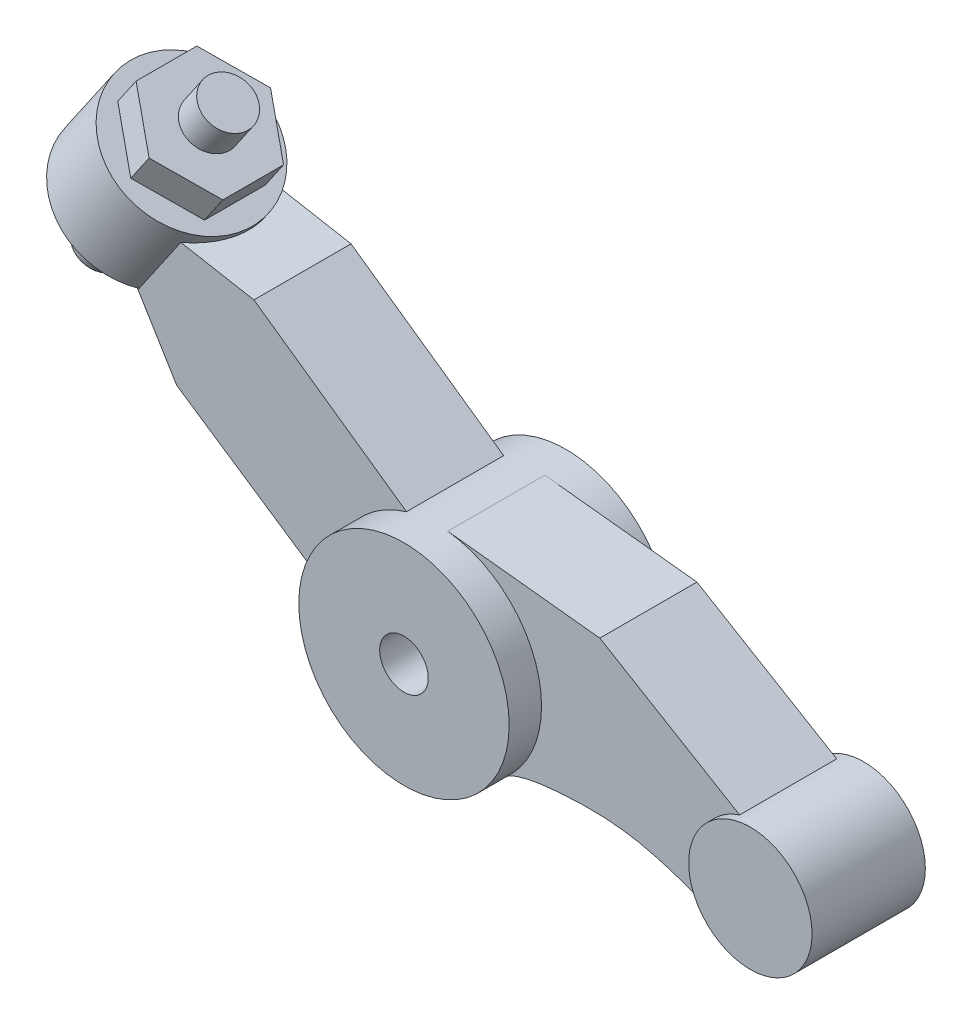
ISO-10303-21;
HEADER;
FILE_DESCRIPTION(('STEP AP214'),'2;1');
FILE_NAME('part.step','',(''),(''),'','','');
FILE_SCHEMA(('AUTOMOTIVE_DESIGN { 1 0 10303 214 1 1 1 1 }'));
ENDSEC;
DATA;
#1=APPLICATION_CONTEXT('core data for automotive mechanical design processes');
#2=APPLICATION_PROTOCOL_DEFINITION('international standard','automotive_design',2000,#1);
#3=PRODUCT_CONTEXT('',#1,'mechanical');
#4=PRODUCT('Part','Part','',(#3));
#5=PRODUCT_RELATED_PRODUCT_CATEGORY('part','',(#4));
#6=PRODUCT_DEFINITION_FORMATION('','',#4);
#7=PRODUCT_DEFINITION_CONTEXT('part definition',#1,'design');
#8=PRODUCT_DEFINITION('design','',#6,#7);
#9=PRODUCT_DEFINITION_SHAPE('','',#8);
#10=(LENGTH_UNIT() NAMED_UNIT(*) SI_UNIT(.MILLI.,.METRE.));
#11=(NAMED_UNIT(*) PLANE_ANGLE_UNIT() SI_UNIT($,.RADIAN.));
#12=(NAMED_UNIT(*) SI_UNIT($,.STERADIAN.) SOLID_ANGLE_UNIT());
#13=UNCERTAINTY_MEASURE_WITH_UNIT(LENGTH_MEASURE(1.E-05),#10,'distance_accuracy_value','');
#14=(GEOMETRIC_REPRESENTATION_CONTEXT(3) GLOBAL_UNCERTAINTY_ASSIGNED_CONTEXT((#13)) GLOBAL_UNIT_ASSIGNED_CONTEXT((#10,
#11,#12)) REPRESENTATION_CONTEXT('',''));
#15=CARTESIAN_POINT('',(0.,0.,0.));
#16=DIRECTION('',(0.,0.,1.));
#17=DIRECTION('',(1.,0.,0.));
#18=AXIS2_PLACEMENT_3D('',#15,#16,#17);
#19=CARTESIAN_POINT('',(0.,0.,1.));
#20=DIRECTION('',(0.,0.,-1.));
#21=DIRECTION('',(-1.,0.,0.));
#22=AXIS2_PLACEMENT_3D('',#19,#20,#21);
#23=CYLINDRICAL_SURFACE('',#22,0.3);
#24=CARTESIAN_POINT('',(0.,0.,1.));
#25=DIRECTION('',(0.,0.,1.));
#26=DIRECTION('',(1.,0.,0.));
#27=AXIS2_PLACEMENT_3D('',#24,#25,#26);
#28=CIRCLE('',#27,0.3);
#29=CARTESIAN_POINT('',(0.3,0.,1.));
#30=VERTEX_POINT('',#29);
#31=EDGE_CURVE('E330',#30,#30,#28,.T.);
#32=ORIENTED_EDGE('',*,*,#31,.T.);
#33=EDGE_LOOP('',(#32));
#34=FACE_BOUND('',#33,.T.);
#35=CARTESIAN_POINT('',(0.,0.,-1.));
#36=DIRECTION('',(0.,0.,1.));
#37=DIRECTION('',(1.,0.,0.));
#38=AXIS2_PLACEMENT_3D('',#35,#36,#37);
#39=CIRCLE('',#38,0.3);
#40=CARTESIAN_POINT('',(0.3,0.,-1.));
#41=VERTEX_POINT('',#40);
#42=EDGE_CURVE('E331',#41,#41,#39,.T.);
#43=ORIENTED_EDGE('',*,*,#42,.F.);
#44=EDGE_LOOP('',(#43));
#45=FACE_BOUND('',#44,.T.);
#46=ADVANCED_FACE('F41',(#34,#45),#23,.F.);
#47=CARTESIAN_POINT('',(0.,0.,1.));
#48=DIRECTION('',(0.,0.,-1.));
#49=DIRECTION('',(-1.,0.,0.));
#50=AXIS2_PLACEMENT_3D('',#47,#48,#49);
#51=CYLINDRICAL_SURFACE('',#50,1.3);
#52=DIRECTION('',(0.,0.,-1.));
#53=VECTOR('',#52,1.);
#54=CARTESIAN_POINT('',(-0.368782160994087,1.24659525016444,0.6));
#55=LINE('',#54,#53);
#56=CARTESIAN_POINT('',(-0.368782160994086,1.24659525016444,0.6));
#57=VERTEX_POINT('',#56);
#58=CARTESIAN_POINT('',(-0.368782160994086,1.24659525016444,-0.6));
#59=VERTEX_POINT('',#58);
#60=EDGE_CURVE('E268',#57,#59,#55,.T.);
#61=ORIENTED_EDGE('',*,*,#60,.F.);
#62=CARTESIAN_POINT('',(0.,0.,0.6));
#63=DIRECTION('',(0.,0.,1.));
#64=DIRECTION('',(1.,0.,0.));
#65=AXIS2_PLACEMENT_3D('',#62,#63,#64);
#66=CIRCLE('',#65,1.3);
#67=CARTESIAN_POINT('',(-1.29584863415519,-0.103809042756995,0.6));
#68=VERTEX_POINT('',#67);
#69=EDGE_CURVE('E223',#57,#68,#66,.T.);
#70=ORIENTED_EDGE('',*,*,#69,.T.);
#71=DIRECTION('',(0.,0.,-1.));
#72=VECTOR('',#71,1.);
#73=CARTESIAN_POINT('',(-1.29584863415519,-0.103809042756995,0.6));
#74=LINE('',#73,#72);
#75=CARTESIAN_POINT('',(-1.29584863415519,-0.103809042756995,-0.6));
#76=VERTEX_POINT('',#75);
#77=EDGE_CURVE('E241',#68,#76,#74,.T.);
#78=ORIENTED_EDGE('',*,*,#77,.T.);
#79=CARTESIAN_POINT('',(0.,0.,-0.6));
#80=DIRECTION('',(0.,0.,1.));
#81=DIRECTION('',(1.,0.,0.));
#82=AXIS2_PLACEMENT_3D('',#79,#80,#81);
#83=CIRCLE('',#82,1.3);
#84=EDGE_CURVE('E222',#59,#76,#83,.T.);
#85=ORIENTED_EDGE('',*,*,#84,.F.);
#86=EDGE_LOOP('',(#61,#70,#78,#85));
#87=FACE_BOUND('',#86,.T.);
#88=DIRECTION('',(0.,0.,-1.));
#89=VECTOR('',#88,1.);
#90=CARTESIAN_POINT('',(0.856533864157858,-0.977931357279645,0.6));
#91=LINE('',#90,#89);
#92=CARTESIAN_POINT('',(0.856533864157858,-0.977931357279645,0.6));
#93=VERTEX_POINT('',#92);
#94=CARTESIAN_POINT('',(0.856533864157858,-0.977931357279645,-0.6));
#95=VERTEX_POINT('',#94);
#96=EDGE_CURVE('E320',#93,#95,#91,.T.);
#97=ORIENTED_EDGE('',*,*,#96,.F.);
#98=CARTESIAN_POINT('',(0.,0.,0.6));
#99=DIRECTION('',(0.,0.,1.));
#100=DIRECTION('',(1.,0.,0.));
#101=AXIS2_PLACEMENT_3D('',#98,#99,#100);
#102=CIRCLE('',#101,1.3);
#103=CARTESIAN_POINT('',(0.140477620780461,1.29238772744864,0.6));
#104=VERTEX_POINT('',#103);
#105=EDGE_CURVE('E442',#93,#104,#102,.T.);
#106=ORIENTED_EDGE('',*,*,#105,.T.);
#107=DIRECTION('',(0.,0.,-1.));
#108=VECTOR('',#107,1.);
#109=CARTESIAN_POINT('',(0.140477620780461,1.29238772744864,0.6));
#110=LINE('',#109,#108);
#111=CARTESIAN_POINT('',(0.140477620780461,1.29238772744864,-0.6));
#112=VERTEX_POINT('',#111);
#113=EDGE_CURVE('E426',#104,#112,#110,.T.);
#114=ORIENTED_EDGE('',*,*,#113,.T.);
#115=CARTESIAN_POINT('',(0.,0.,-0.6));
#116=DIRECTION('',(0.,0.,1.));
#117=DIRECTION('',(1.,0.,0.));
#118=AXIS2_PLACEMENT_3D('',#115,#116,#117);
#119=CIRCLE('',#118,1.3);
#120=EDGE_CURVE('E289',#95,#112,#119,.T.);
#121=ORIENTED_EDGE('',*,*,#120,.F.);
#122=EDGE_LOOP('',(#97,#106,#114,#121));
#123=FACE_BOUND('',#122,.T.);
#124=CARTESIAN_POINT('',(0.,0.,1.));
#125=DIRECTION('',(0.,0.,1.));
#126=DIRECTION('',(1.,0.,0.));
#127=AXIS2_PLACEMENT_3D('',#124,#125,#126);
#128=CIRCLE('',#127,1.3);
#129=CARTESIAN_POINT('',(1.3,0.,1.));
#130=VERTEX_POINT('',#129);
#131=EDGE_CURVE('E324',#130,#130,#128,.T.);
#132=ORIENTED_EDGE('',*,*,#131,.F.);
#133=EDGE_LOOP('',(#132));
#134=FACE_BOUND('',#133,.T.);
#135=CARTESIAN_POINT('',(0.,0.,-1.));
#136=DIRECTION('',(0.,0.,1.));
#137=DIRECTION('',(1.,0.,0.));
#138=AXIS2_PLACEMENT_3D('',#135,#136,#137);
#139=CIRCLE('',#138,1.3);
#140=CARTESIAN_POINT('',(1.3,0.,-1.));
#141=VERTEX_POINT('',#140);
#142=EDGE_CURVE('E327',#141,#141,#139,.T.);
#143=ORIENTED_EDGE('',*,*,#142,.T.);
#144=EDGE_LOOP('',(#143));
#145=FACE_BOUND('',#144,.T.);
#146=ADVANCED_FACE('F306',(#87,#123,#134,#145),#51,.T.);
#147=CARTESIAN_POINT('',(0.,0.,1.));
#148=DIRECTION('',(0.,0.,1.));
#149=DIRECTION('',(1.,0.,0.));
#150=AXIS2_PLACEMENT_3D('',#147,#148,#149);
#151=PLANE('',#150);
#152=ORIENTED_EDGE('',*,*,#31,.F.);
#153=EDGE_LOOP('',(#152));
#154=FACE_BOUND('',#153,.T.);
#155=ORIENTED_EDGE('',*,*,#131,.T.);
#156=EDGE_LOOP('',(#155));
#157=FACE_BOUND('',#156,.T.);
#158=ADVANCED_FACE('F303',(#154,#157),#151,.T.);
#159=CARTESIAN_POINT('',(0.,0.,-1.));
#160=DIRECTION('',(0.,0.,1.));
#161=DIRECTION('',(1.,0.,0.));
#162=AXIS2_PLACEMENT_3D('',#159,#160,#161);
#163=PLANE('',#162);
#164=ORIENTED_EDGE('',*,*,#42,.T.);
#165=EDGE_LOOP('',(#164));
#166=FACE_BOUND('',#165,.T.);
#167=ORIENTED_EDGE('',*,*,#142,.F.);
#168=EDGE_LOOP('',(#167));
#169=FACE_BOUND('',#168,.T.);
#170=ADVANCED_FACE('F300',(#166,#169),#163,.F.);
#171=CARTESIAN_POINT('',(3.37435099411818,-1.12949006021291,0.6));
#172=CARTESIAN_POINT('',(2.7784763450981,-0.906598449555671,0.6));
#173=CARTESIAN_POINT('',(2.40696699317631,-0.786012748574951,0.6));
#174=CARTESIAN_POINT('',(1.50197991959616,-0.807474496325773,0.6));
#175=CARTESIAN_POINT('',(0.99648315509414,-0.855354955511263,0.6));
#176=CARTESIAN_POINT('',(0.856533864157858,-0.977931357279645,0.6));
#177=B_SPLINE_CURVE_WITH_KNOTS('',3,(#171,#172,#173,#174,#175,#176),.UNSPECIFIED.,.F.,.F.,(4,1,
1,4),(0.,0.647248285514099,0.718239716660931,1.),.UNSPECIFIED.);
#178=DIRECTION('',(0.,0.,-1.));
#179=VECTOR('',#178,1.);
#180=SURFACE_OF_LINEAR_EXTRUSION('',#177,#179);
#181=CARTESIAN_POINT('',(3.37435099411818,-1.12949006021291,-0.6));
#182=CARTESIAN_POINT('',(2.7784763450981,-0.906598449555671,-0.6));
#183=CARTESIAN_POINT('',(2.40696699317631,-0.786012748574951,-0.6));
#184=CARTESIAN_POINT('',(1.50197991959616,-0.807474496325773,-0.6));
#185=CARTESIAN_POINT('',(0.99648315509414,-0.855354955511263,-0.6));
#186=CARTESIAN_POINT('',(0.856533864157858,-0.977931357279645,-0.6));
#187=B_SPLINE_CURVE_WITH_KNOTS('',3,(#181,#182,#183,#184,#185,#186),.UNSPECIFIED.,.F.,.F.,(4,1,
1,4),(0.,0.647248285514099,0.718239716660931,1.),.UNSPECIFIED.);
#188=CARTESIAN_POINT('',(3.37435099411818,-1.12949006021291,-0.6));
#189=VERTEX_POINT('',#188);
#190=EDGE_CURVE('E277',#189,#95,#187,.T.);
#191=ORIENTED_EDGE('',*,*,#190,.F.);
#192=DIRECTION('',(0.,0.,-1.));
#193=VECTOR('',#192,1.);
#194=CARTESIAN_POINT('',(3.37435099411818,-1.12949006021291,0.6));
#195=LINE('',#194,#193);
#196=CARTESIAN_POINT('',(3.37435099411818,-1.12949006021291,0.6));
#197=VERTEX_POINT('',#196);
#198=EDGE_CURVE('E338',#197,#189,#195,.T.);
#199=ORIENTED_EDGE('',*,*,#198,.F.);
#200=EDGE_CURVE('E281',#197,#93,#177,.T.);
#201=ORIENTED_EDGE('',*,*,#200,.T.);
#202=ORIENTED_EDGE('',*,*,#96,.T.);
#203=EDGE_LOOP('',(#191,#199,#201,#202));
#204=FACE_BOUND('',#203,.T.);
#205=ADVANCED_FACE('F295',(#204),#180,.T.);
#206=CARTESIAN_POINT('',(1.00677750375807,1.69124025540544,0.6));
#207=DIRECTION('',(-0.51151645102772,-0.859273484013097,0.));
#208=DIRECTION('',(0.859273484013097,-0.51151645102772,0.));
#209=AXIS2_PLACEMENT_3D('',#206,#207,#208);
#210=PLANE('',#209);
#211=DIRECTION('',(-0.859273484013097,0.51151645102772,0.));
#212=VECTOR('',#211,1.);
#213=CARTESIAN_POINT('',(1.00677750375807,1.69124025540544,-0.6));
#214=LINE('',#213,#212);
#215=CARTESIAN_POINT('',(3.74725300527709,0.0598640652330697,-0.6));
#216=VERTEX_POINT('',#215);
#217=CARTESIAN_POINT('',(2.01997692525244,1.08809331568416,-0.6));
#218=VERTEX_POINT('',#217);
#219=EDGE_CURVE('E431',#216,#218,#214,.T.);
#220=ORIENTED_EDGE('',*,*,#219,.T.);
#221=DIRECTION('',(0.,0.,-1.));
#222=VECTOR('',#221,1.);
#223=CARTESIAN_POINT('',(2.01997692525244,1.08809331568416,0.6));
#224=LINE('',#223,#222);
#225=CARTESIAN_POINT('',(2.01997692525244,1.08809331568416,0.6));
#226=VERTEX_POINT('',#225);
#227=EDGE_CURVE('E428',#226,#218,#224,.T.);
#228=ORIENTED_EDGE('',*,*,#227,.F.);
#229=DIRECTION('',(-0.859273484013097,0.51151645102772,0.));
#230=VECTOR('',#229,1.);
#231=CARTESIAN_POINT('',(1.00677750375807,1.69124025540544,0.6));
#232=LINE('',#231,#230);
#233=CARTESIAN_POINT('',(3.74725300527709,0.0598640652330697,0.6));
#234=VERTEX_POINT('',#233);
#235=EDGE_CURVE('E475',#234,#226,#232,.T.);
#236=ORIENTED_EDGE('',*,*,#235,.F.);
#237=DIRECTION('',(0.,0.,-1.));
#238=VECTOR('',#237,1.);
#239=CARTESIAN_POINT('',(3.7472530052771,0.05986406523307,0.6));
#240=LINE('',#239,#238);
#241=EDGE_CURVE('E447',#234,#216,#240,.T.);
#242=ORIENTED_EDGE('',*,*,#241,.T.);
#243=EDGE_LOOP('',(#220,#228,#236,#242));
#244=FACE_BOUND('',#243,.T.);
#245=ADVANCED_FACE('F299',(#244),#210,.F.);
#246=CARTESIAN_POINT('',(0.140477620780461,1.29238772744864,0.6));
#247=DIRECTION('',(-0.108059708292662,-0.994144405729723,0.));
#248=DIRECTION('',(0.994144405729724,-0.108059708292662,0.));
#249=AXIS2_PLACEMENT_3D('',#246,#247,#248);
#250=PLANE('',#249);
#251=DIRECTION('',(-0.994144405729723,0.108059708292662,0.));
#252=VECTOR('',#251,1.);
#253=CARTESIAN_POINT('',(0.140477620780461,1.29238772744864,-0.6));
#254=LINE('',#253,#252);
#255=EDGE_CURVE('E423',#218,#112,#254,.T.);
#256=ORIENTED_EDGE('',*,*,#255,.T.);
#257=ORIENTED_EDGE('',*,*,#113,.F.);
#258=DIRECTION('',(-0.994144405729723,0.108059708292662,0.));
#259=VECTOR('',#258,1.);
#260=CARTESIAN_POINT('',(0.140477620780461,1.29238772744864,0.6));
#261=LINE('',#260,#259);
#262=EDGE_CURVE('E472',#226,#104,#261,.T.);
#263=ORIENTED_EDGE('',*,*,#262,.F.);
#264=ORIENTED_EDGE('',*,*,#227,.T.);
#265=EDGE_LOOP('',(#256,#257,#263,#264));
#266=FACE_BOUND('',#265,.T.);
#267=ADVANCED_FACE('F409',(#266),#250,.F.);
#268=CARTESIAN_POINT('',(0.,0.,0.6));
#269=DIRECTION('',(0.,0.,1.));
#270=DIRECTION('',(1.,0.,0.));
#271=AXIS2_PLACEMENT_3D('',#268,#269,#270);
#272=PLANE('',#271);
#273=ORIENTED_EDGE('',*,*,#200,.F.);
#274=CARTESIAN_POINT('',(3.98,-0.666245490169871,0.6));
#275=DIRECTION('',(0.,0.,1.));
#276=DIRECTION('',(1.,0.,0.));
#277=AXIS2_PLACEMENT_3D('',#274,#275,#276);
#278=CIRCLE('',#277,0.7625);
#279=EDGE_CURVE('E288',#234,#197,#278,.T.);
#280=ORIENTED_EDGE('',*,*,#279,.F.);
#281=ORIENTED_EDGE('',*,*,#235,.T.);
#282=ORIENTED_EDGE('',*,*,#262,.T.);
#283=ORIENTED_EDGE('',*,*,#105,.F.);
#284=EDGE_LOOP('',(#273,#280,#281,#282,#283));
#285=FACE_BOUND('',#284,.T.);
#286=ADVANCED_FACE('F406',(#285),#272,.T.);
#287=CARTESIAN_POINT('',(0.,0.,-0.6));
#288=DIRECTION('',(0.,0.,1.));
#289=DIRECTION('',(1.,0.,0.));
#290=AXIS2_PLACEMENT_3D('',#287,#288,#289);
#291=PLANE('',#290);
#292=ORIENTED_EDGE('',*,*,#190,.T.);
#293=ORIENTED_EDGE('',*,*,#120,.T.);
#294=ORIENTED_EDGE('',*,*,#255,.F.);
#295=ORIENTED_EDGE('',*,*,#219,.F.);
#296=CARTESIAN_POINT('',(3.98,-0.666245490169871,-0.6));
#297=DIRECTION('',(0.,0.,1.));
#298=DIRECTION('',(1.,0.,0.));
#299=AXIS2_PLACEMENT_3D('',#296,#297,#298);
#300=CIRCLE('',#299,0.7625);
#301=EDGE_CURVE('E456',#216,#189,#300,.T.);
#302=ORIENTED_EDGE('',*,*,#301,.T.);
#303=EDGE_LOOP('',(#292,#293,#294,#295,#302));
#304=FACE_BOUND('',#303,.T.);
#305=ADVANCED_FACE('F404',(#304),#291,.F.);
#306=CARTESIAN_POINT('',(3.98,-0.666245490169871,0.7));
#307=DIRECTION('',(0.,0.,-1.));
#308=DIRECTION('',(-1.,0.,0.));
#309=AXIS2_PLACEMENT_3D('',#306,#307,#308);
#310=CYLINDRICAL_SURFACE('',#309,0.7625);
#311=ORIENTED_EDGE('',*,*,#279,.T.);
#312=ORIENTED_EDGE('',*,*,#198,.T.);
#313=ORIENTED_EDGE('',*,*,#301,.F.);
#314=ORIENTED_EDGE('',*,*,#241,.F.);
#315=EDGE_LOOP('',(#311,#312,#313,#314));
#316=FACE_BOUND('',#315,.T.);
#317=CARTESIAN_POINT('',(3.98,-0.666245490169871,0.7));
#318=DIRECTION('',(0.,0.,1.));
#319=DIRECTION('',(1.,0.,0.));
#320=AXIS2_PLACEMENT_3D('',#317,#318,#319);
#321=CIRCLE('',#320,0.7625);
#322=CARTESIAN_POINT('',(4.7425,-0.666245490169871,0.7));
#323=VERTEX_POINT('',#322);
#324=EDGE_CURVE('E273',#323,#323,#321,.T.);
#325=ORIENTED_EDGE('',*,*,#324,.F.);
#326=EDGE_LOOP('',(#325));
#327=FACE_BOUND('',#326,.T.);
#328=CARTESIAN_POINT('',(3.98,-0.666245490169871,-0.7));
#329=DIRECTION('',(0.,0.,1.));
#330=DIRECTION('',(1.,0.,0.));
#331=AXIS2_PLACEMENT_3D('',#328,#329,#330);
#332=CIRCLE('',#331,0.7625);
#333=CARTESIAN_POINT('',(4.7425,-0.666245490169871,-0.7));
#334=VERTEX_POINT('',#333);
#335=EDGE_CURVE('E272',#334,#334,#332,.T.);
#336=ORIENTED_EDGE('',*,*,#335,.T.);
#337=EDGE_LOOP('',(#336));
#338=FACE_BOUND('',#337,.T.);
#339=ADVANCED_FACE('F397',(#316,#327,#338),#310,.T.);
#340=CARTESIAN_POINT('',(0.,0.,0.7));
#341=DIRECTION('',(0.,0.,1.));
#342=DIRECTION('',(1.,0.,0.));
#343=AXIS2_PLACEMENT_3D('',#340,#341,#342);
#344=PLANE('',#343);
#345=ORIENTED_EDGE('',*,*,#324,.T.);
#346=EDGE_LOOP('',(#345));
#347=FACE_BOUND('',#346,.T.);
#348=ADVANCED_FACE('F394',(#347),#344,.T.);
#349=CARTESIAN_POINT('',(0.,0.,-0.7));
#350=DIRECTION('',(0.,0.,1.));
#351=DIRECTION('',(1.,0.,0.));
#352=AXIS2_PLACEMENT_3D('',#349,#350,#351);
#353=PLANE('',#352);
#354=ORIENTED_EDGE('',*,*,#335,.F.);
#355=EDGE_LOOP('',(#354));
#356=FACE_BOUND('',#355,.T.);
#357=ADVANCED_FACE('F393',(#356),#353,.F.);
#358=CARTESIAN_POINT('',(0.464485667568718,0.661494036164967,0.6));
#359=DIRECTION('',(0.574657276817286,0.818394167990548,0.));
#360=DIRECTION('',(-0.818394167990548,0.574657276817286,0.));
#361=AXIS2_PLACEMENT_3D('',#358,#359,#360);
#362=PLANE('',#361);
#363=DIRECTION('',(0.818394167990548,-0.574657276817286,0.));
#364=VECTOR('',#363,1.);
#365=CARTESIAN_POINT('',(0.464485667568718,0.661494036164967,-0.6));
#366=LINE('',#365,#364);
#367=CARTESIAN_POINT('',(-2.25421296575328,2.57050074004674,-0.6));
#368=VERTEX_POINT('',#367);
#369=EDGE_CURVE('E245',#368,#59,#366,.T.);
#370=ORIENTED_EDGE('',*,*,#369,.F.);
#371=DIRECTION('',(0.,0.,-1.));
#372=VECTOR('',#371,1.);
#373=CARTESIAN_POINT('',(-2.25421296575328,2.57050074004674,0.6));
#374=LINE('',#373,#372);
#375=CARTESIAN_POINT('',(-2.25421296575328,2.57050074004674,0.6));
#376=VERTEX_POINT('',#375);
#377=EDGE_CURVE('E264',#376,#368,#374,.T.);
#378=ORIENTED_EDGE('',*,*,#377,.F.);
#379=DIRECTION('',(0.818394167990548,-0.574657276817286,0.));
#380=VECTOR('',#379,1.);
#381=CARTESIAN_POINT('',(0.464485667568718,0.661494036164967,0.6));
#382=LINE('',#381,#380);
#383=EDGE_CURVE('E226',#376,#57,#382,.T.);
#384=ORIENTED_EDGE('',*,*,#383,.T.);
#385=ORIENTED_EDGE('',*,*,#60,.T.);
#386=EDGE_LOOP('',(#370,#378,#384,#385));
#387=FACE_BOUND('',#386,.T.);
#388=ADVANCED_FACE('F376',(#387),#362,.T.);
#389=CARTESIAN_POINT('',(0.37991682349805,2.09216938171615,0.6));
#390=DIRECTION('',(0.17866801025971,0.983909417634487,0.));
#391=DIRECTION('',(-0.983909417634487,0.17866801025971,0.));
#392=AXIS2_PLACEMENT_3D('',#389,#390,#391);
#393=PLANE('',#392);
#394=CARTESIAN_POINT('',(-3.89543486034177,2.86853005559673,0.));
#395=DIRECTION('',(0.17866801025971,0.983909417634487,0.));
#396=DIRECTION('',(0.983909417634487,-0.17866801025971,0.));
#397=AXIS2_PLACEMENT_3D('',#394,#395,#396);
#398=ELLIPSE('',#397,0.997502113347114,0.91);
#399=CARTESIAN_POINT('',(-3.15753594796304,2.73453506776088,0.6));
#400=VERTEX_POINT('',#399);
#401=CARTESIAN_POINT('',(-3.15753594796304,2.73453506776088,-0.6));
#402=VERTEX_POINT('',#401);
#403=EDGE_CURVE('E209',#400,#402,#398,.T.);
#404=ORIENTED_EDGE('',*,*,#403,.F.);
#405=DIRECTION('',(0.983909417634487,-0.17866801025971,0.));
#406=VECTOR('',#405,1.);
#407=CARTESIAN_POINT('',(0.37991682349805,2.09216938171615,0.6));
#408=LINE('',#407,#406);
#409=EDGE_CURVE('E231',#400,#376,#408,.T.);
#410=ORIENTED_EDGE('',*,*,#409,.T.);
#411=ORIENTED_EDGE('',*,*,#377,.T.);
#412=DIRECTION('',(0.983909417634487,-0.17866801025971,0.));
#413=VECTOR('',#412,1.);
#414=CARTESIAN_POINT('',(0.37991682349805,2.09216938171615,-0.6));
#415=LINE('',#414,#413);
#416=EDGE_CURVE('E249',#402,#368,#415,.T.);
#417=ORIENTED_EDGE('',*,*,#416,.F.);
#418=EDGE_LOOP('',(#404,#410,#411,#417));
#419=FACE_BOUND('',#418,.T.);
#420=ADVANCED_FACE('F371',(#419),#393,.T.);
#421=CARTESIAN_POINT('',(-1.81590079788309,-1.10635157468815,0.6));
#422=DIRECTION('',(0.853985299728259,0.520297134191642,0.));
#423=DIRECTION('',(-0.520297134191642,0.853985299728259,0.));
#424=AXIS2_PLACEMENT_3D('',#421,#422,#423);
#425=PLANE('',#424);
#426=DIRECTION('',(0.520297134191642,-0.853985299728259,0.));
#427=VECTOR('',#426,1.);
#428=CARTESIAN_POINT('',(-1.81590079788309,-1.10635157468815,0.6));
#429=LINE('',#428,#427);
#430=CARTESIAN_POINT('',(-3.71791623826019,2.01550537818897,0.6));
#431=VERTEX_POINT('',#430);
#432=CARTESIAN_POINT('',(-3.20884424966072,1.17994437621879,0.6));
#433=VERTEX_POINT('',#432);
#434=EDGE_CURVE('E234',#431,#433,#429,.T.);
#435=ORIENTED_EDGE('',*,*,#434,.F.);
#436=DIRECTION('',(0.,0.,-1.));
#437=VECTOR('',#436,1.);
#438=CARTESIAN_POINT('',(-3.71791623826019,2.01550537818897,0.6));
#439=LINE('',#438,#437);
#440=CARTESIAN_POINT('',(-3.71791623826019,2.01550537818897,-0.6));
#441=VERTEX_POINT('',#440);
#442=EDGE_CURVE('E215',#431,#441,#439,.T.);
#443=ORIENTED_EDGE('',*,*,#442,.T.);
#444=DIRECTION('',(0.520297134191642,-0.853985299728259,0.));
#445=VECTOR('',#444,1.);
#446=CARTESIAN_POINT('',(-1.81590079788309,-1.10635157468815,-0.6));
#447=LINE('',#446,#445);
#448=CARTESIAN_POINT('',(-3.20884424966072,1.17994437621879,-0.6));
#449=VERTEX_POINT('',#448);
#450=EDGE_CURVE('E252',#441,#449,#447,.T.);
#451=ORIENTED_EDGE('',*,*,#450,.T.);
#452=DIRECTION('',(0.,0.,-1.));
#453=VECTOR('',#452,1.);
#454=CARTESIAN_POINT('',(-3.20884424966072,1.17994437621879,0.6));
#455=LINE('',#454,#453);
#456=EDGE_CURVE('E260',#433,#449,#455,.T.);
#457=ORIENTED_EDGE('',*,*,#456,.F.);
#458=EDGE_LOOP('',(#435,#443,#451,#457));
#459=FACE_BOUND('',#458,.T.);
#460=ADVANCED_FACE('F358',(#459),#425,.F.);
#461=CARTESIAN_POINT('',(-0.450398512857292,-0.671165013148417,0.6));
#462=DIRECTION('',(0.557228782183759,0.830359009288154,0.));
#463=DIRECTION('',(-0.830359009288154,0.557228782183759,0.));
#464=AXIS2_PLACEMENT_3D('',#461,#462,#463);
#465=PLANE('',#464);
#466=DIRECTION('',(0.830359009288154,-0.557228782183759,0.));
#467=VECTOR('',#466,1.);
#468=CARTESIAN_POINT('',(-0.450398512857292,-0.671165013148417,-0.6));
#469=LINE('',#468,#467);
#470=EDGE_CURVE('E227',#449,#76,#469,.T.);
#471=ORIENTED_EDGE('',*,*,#470,.T.);
#472=ORIENTED_EDGE('',*,*,#77,.F.);
#473=DIRECTION('',(0.830359009288154,-0.557228782183759,0.));
#474=VECTOR('',#473,1.);
#475=CARTESIAN_POINT('',(-0.450398512857292,-0.671165013148417,0.6));
#476=LINE('',#475,#474);
#477=EDGE_CURVE('E237',#433,#68,#476,.T.);
#478=ORIENTED_EDGE('',*,*,#477,.F.);
#479=ORIENTED_EDGE('',*,*,#456,.T.);
#480=EDGE_LOOP('',(#471,#472,#478,#479));
#481=FACE_BOUND('',#480,.T.);
#482=ADVANCED_FACE('F378',(#481),#465,.F.);
#483=CARTESIAN_POINT('',(0.,0.,0.6));
#484=DIRECTION('',(0.,0.,1.));
#485=DIRECTION('',(1.,0.,0.));
#486=AXIS2_PLACEMENT_3D('',#483,#484,#485);
#487=PLANE('',#486);
#488=DIRECTION('',(0.824422645251182,-0.565974647839497,0.));
#489=VECTOR('',#488,1.);
#490=CARTESIAN_POINT('',(-0.250510599640649,-0.364904350411419,0.6));
#491=LINE('',#490,#489);
#492=CARTESIAN_POINT('',(-3.67254197310115,1.9843554772343,0.6));
#493=VERTEX_POINT('',#492);
#494=EDGE_CURVE('E219',#431,#493,#491,.T.);
#495=ORIENTED_EDGE('',*,*,#494,.F.);
#496=ORIENTED_EDGE('',*,*,#434,.T.);
#497=ORIENTED_EDGE('',*,*,#477,.T.);
#498=ORIENTED_EDGE('',*,*,#69,.F.);
#499=ORIENTED_EDGE('',*,*,#383,.F.);
#500=ORIENTED_EDGE('',*,*,#409,.F.);
#501=DIRECTION('',(0.565974647839497,0.824422645251182,0.));
#502=VECTOR('',#501,1.);
#503=CARTESIAN_POINT('',(-3.0612893534345,2.87473193410558,0.6));
#504=LINE('',#503,#502);
#505=EDGE_CURVE('E212',#493,#400,#504,.T.);
#506=ORIENTED_EDGE('',*,*,#505,.F.);
#507=EDGE_LOOP('',(#495,#496,#497,#498,#499,#500,#506));
#508=FACE_BOUND('',#507,.T.);
#509=ADVANCED_FACE('F362',(#508),#487,.T.);
#510=CARTESIAN_POINT('',(0.,0.,-0.6));
#511=DIRECTION('',(0.,0.,1.));
#512=DIRECTION('',(1.,0.,0.));
#513=AXIS2_PLACEMENT_3D('',#510,#511,#512);
#514=PLANE('',#513);
#515=ORIENTED_EDGE('',*,*,#450,.F.);
#516=DIRECTION('',(0.824422645251182,-0.565974647839497,0.));
#517=VECTOR('',#516,1.);
#518=CARTESIAN_POINT('',(-0.250510599640649,-0.364904350411419,-0.6));
#519=LINE('',#518,#517);
#520=CARTESIAN_POINT('',(-3.67254197310115,1.9843554772343,-0.6));
#521=VERTEX_POINT('',#520);
#522=EDGE_CURVE('E50',#441,#521,#519,.T.);
#523=ORIENTED_EDGE('',*,*,#522,.T.);
#524=DIRECTION('',(0.565974647839497,0.824422645251182,0.));
#525=VECTOR('',#524,1.);
#526=CARTESIAN_POINT('',(-3.0612893534345,2.87473193410558,-0.6));
#527=LINE('',#526,#525);
#528=EDGE_CURVE('E342',#521,#402,#527,.T.);
#529=ORIENTED_EDGE('',*,*,#528,.T.);
#530=ORIENTED_EDGE('',*,*,#416,.T.);
#531=ORIENTED_EDGE('',*,*,#369,.T.);
#532=ORIENTED_EDGE('',*,*,#84,.T.);
#533=ORIENTED_EDGE('',*,*,#470,.F.);
#534=EDGE_LOOP('',(#515,#523,#529,#530,#531,#532,#533));
#535=FACE_BOUND('',#534,.T.);
#536=ADVANCED_FACE('F349',(#535),#514,.F.);
#537=CARTESIAN_POINT('',(-4.37556607694204,3.77699645829777,0.));
#538=DIRECTION('',(0.565974647839497,0.824422645251182,0.));
#539=DIRECTION('',(-0.824422645251182,0.565974647839497,0.));
#540=AXIS2_PLACEMENT_3D('',#537,#538,#539);
#541=PLANE('',#540);
#542=DIRECTION('',(0.713970954242691,-0.490148422926956,0.5));
#543=VECTOR('',#542,1.);
#544=CARTESIAN_POINT('',(-4.16121618917673,3.6298430498595,0.375277674973256));
#545=LINE('',#544,#543);
#546=CARTESIAN_POINT('',(-4.16121618917673,3.6298430498595,0.375277674973256));
#547=VERTEX_POINT('',#546);
#548=CARTESIAN_POINT('',(-3.62534146976346,3.26195952876383,0.750555349946513));
#549=VERTEX_POINT('',#548);
#550=EDGE_CURVE('E58',#547,#549,#545,.T.);
#551=ORIENTED_EDGE('',*,*,#550,.F.);
#552=DIRECTION('',(0.,0.,1.));
#553=VECTOR('',#552,1.);
#554=CARTESIAN_POINT('',(-4.16121618917673,3.6298430498595,-0.375277674973256));
#555=LINE('',#554,#553);
#556=CARTESIAN_POINT('',(-4.16121618917673,3.6298430498595,-0.375277674973256));
#557=VERTEX_POINT('',#556);
#558=EDGE_CURVE('E62',#557,#547,#555,.T.);
#559=ORIENTED_EDGE('',*,*,#558,.F.);
#560=DIRECTION('',(-0.713970954242691,0.490148422926956,0.5));
#561=VECTOR('',#560,1.);
#562=CARTESIAN_POINT('',(-3.62534146976346,3.26195952876383,-0.750555349946513));
#563=LINE('',#562,#561);
#564=CARTESIAN_POINT('',(-3.62534146976346,3.26195952876383,-0.750555349946513));
#565=VERTEX_POINT('',#564);
#566=EDGE_CURVE('E748',#565,#557,#563,.T.);
#567=ORIENTED_EDGE('',*,*,#566,.F.);
#568=DIRECTION('',(-0.71397095424269,0.490148422926956,-0.5));
#569=VECTOR('',#568,1.);
#570=CARTESIAN_POINT('',(-3.08946675035019,2.89407600766816,-0.375277674973257));
#571=LINE('',#570,#569);
#572=CARTESIAN_POINT('',(-3.08946675035019,2.89407600766816,-0.375277674973257));
#573=VERTEX_POINT('',#572);
#574=EDGE_CURVE('E744',#573,#565,#571,.T.);
#575=ORIENTED_EDGE('',*,*,#574,.F.);
#576=DIRECTION('',(0.,0.,-1.));
#577=VECTOR('',#576,1.);
#578=CARTESIAN_POINT('',(-3.08946675035019,2.89407600766816,0.375277674973256));
#579=LINE('',#578,#577);
#580=CARTESIAN_POINT('',(-3.08946675035019,2.89407600766816,0.375277674973256));
#581=VERTEX_POINT('',#580);
#582=EDGE_CURVE('E740',#581,#573,#579,.T.);
#583=ORIENTED_EDGE('',*,*,#582,.F.);
#584=DIRECTION('',(0.71397095424269,-0.490148422926956,-0.5));
#585=VECTOR('',#584,1.);
#586=CARTESIAN_POINT('',(-3.62534146976346,3.26195952876383,0.750555349946513));
#587=LINE('',#586,#585);
#588=EDGE_CURVE('E724',#549,#581,#587,.T.);
#589=ORIENTED_EDGE('',*,*,#588,.F.);
#590=EDGE_LOOP('',(#551,#559,#567,#575,#583,#589));
#591=FACE_BOUND('',#590,.T.);
#592=CARTESIAN_POINT('',(-3.62534146976346,3.26195952876383,0.));
#593=DIRECTION('',(0.565974647839497,0.824422645251182,0.));
#594=DIRECTION('',(-0.824422645251182,0.565974647839497,0.));
#595=AXIS2_PLACEMENT_3D('',#592,#593,#594);
#596=CIRCLE('',#595,0.91);
#597=CARTESIAN_POINT('',(-4.37556607694204,3.77699645829777,0.));
#598=VERTEX_POINT('',#597);
#599=EDGE_CURVE('E201',#598,#598,#596,.T.);
#600=ORIENTED_EDGE('',*,*,#599,.T.);
#601=EDGE_LOOP('',(#600));
#602=FACE_BOUND('',#601,.T.);
#603=ADVANCED_FACE('F504',(#591,#602),#541,.T.);
#604=CARTESIAN_POINT('',(-4.23659408943012,2.37158307189255,0.));
#605=DIRECTION('',(-0.565974647839497,-0.824422645251182,0.));
#606=DIRECTION('',(0.824422645251182,-0.565974647839497,0.));
#607=AXIS2_PLACEMENT_3D('',#604,#605,#606);
#608=PLANE('',#607);
#609=CARTESIAN_POINT('',(-4.23659408943012,2.37158307189255,0.));
#610=DIRECTION('',(-0.565974647839497,-0.824422645251182,0.));
#611=DIRECTION('',(0.824422645251182,-0.565974647839497,0.));
#612=AXIS2_PLACEMENT_3D('',#609,#610,#611);
#613=CIRCLE('',#612,0.348366007499576);
#614=CARTESIAN_POINT('',(-3.94939326401172,2.17441674347873,0.));
#615=VERTEX_POINT('',#614);
#616=EDGE_CURVE('E44',#615,#615,#613,.F.);
#617=ORIENTED_EDGE('',*,*,#616,.T.);
#618=EDGE_LOOP('',(#617));
#619=FACE_BOUND('',#618,.T.);
#620=ORIENTED_EDGE('',*,*,#442,.F.);
#621=ORIENTED_EDGE('',*,*,#494,.T.);
#622=CARTESIAN_POINT('',(-4.23659408943012,2.37158307189255,0.));
#623=DIRECTION('',(0.565974647839497,0.824422645251182,0.));
#624=DIRECTION('',(-0.824422645251182,0.565974647839497,0.));
#625=AXIS2_PLACEMENT_3D('',#622,#623,#624);
#626=CIRCLE('',#625,0.91);
#627=EDGE_CURVE('E205',#521,#493,#626,.T.);
#628=ORIENTED_EDGE('',*,*,#627,.F.);
#629=ORIENTED_EDGE('',*,*,#522,.F.);
#630=EDGE_LOOP('',(#620,#621,#628,#629));
#631=FACE_BOUND('',#630,.T.);
#632=ADVANCED_FACE('F354',(#619,#631),#608,.T.);
#633=CARTESIAN_POINT('',(-3.62534146976346,3.26195952876383,0.));
#634=DIRECTION('',(0.565974647839497,0.824422645251182,0.));
#635=DIRECTION('',(-0.824422645251182,0.565974647839497,0.));
#636=AXIS2_PLACEMENT_3D('',#633,#634,#635);
#637=CYLINDRICAL_SURFACE('',#636,0.91);
#638=ORIENTED_EDGE('',*,*,#627,.T.);
#639=ORIENTED_EDGE('',*,*,#505,.T.);
#640=ORIENTED_EDGE('',*,*,#403,.T.);
#641=ORIENTED_EDGE('',*,*,#528,.F.);
#642=EDGE_LOOP('',(#638,#639,#640,#641));
#643=FACE_BOUND('',#642,.T.);
#644=ORIENTED_EDGE('',*,*,#599,.F.);
#645=EDGE_LOOP('',(#644));
#646=FACE_BOUND('',#645,.T.);
#647=ADVANCED_FACE('F367',(#643,#646),#637,.T.);
#648=CARTESIAN_POINT('',(-4.46234537289161,2.04274419016768,0.));
#649=DIRECTION('',(0.565974647839502,0.824422645251179,0.));
#650=DIRECTION('',(-0.824422645251179,0.565974647839502,0.));
#651=AXIS2_PLACEMENT_3D('',#648,#649,#650);
#652=CONICAL_SURFACE('',#651,0.171412767574329,0.417547743525641);
#653=ORIENTED_EDGE('',*,*,#616,.F.);
#654=EDGE_LOOP('',(#653));
#655=FACE_BOUND('',#654,.T.);
#656=CARTESIAN_POINT('',(-4.46234537289161,2.04274419016768,0.));
#657=DIRECTION('',(0.565974647839502,0.824422645251179,0.));
#658=DIRECTION('',(-0.824422645251179,0.565974647839502,0.));
#659=AXIS2_PLACEMENT_3D('',#656,#657,#658);
#660=CIRCLE('',#659,0.171412767574329);
#661=CARTESIAN_POINT('',(-4.60366194016506,2.13975947093075,0.));
#662=VERTEX_POINT('',#661);
#663=EDGE_CURVE('E191',#662,#662,#660,.T.);
#664=ORIENTED_EDGE('',*,*,#663,.T.);
#665=EDGE_LOOP('',(#664));
#666=FACE_BOUND('',#665,.T.);
#667=ADVANCED_FACE('F485',(#655,#666),#652,.T.);
#668=CARTESIAN_POINT('',(-4.63505359444779,1.79117007917966,0.));
#669=DIRECTION('',(0.565974647839502,0.824422645251179,0.));
#670=DIRECTION('',(0.824422645251179,-0.565974647839502,0.));
#671=AXIS2_PLACEMENT_3D('',#668,#669,#670);
#672=SPHERICAL_SURFACE('',#671,0.35);
#673=ORIENTED_EDGE('',*,*,#663,.F.);
#674=EDGE_LOOP('',(#673));
#675=FACE_BOUND('',#674,.T.);
#676=ADVANCED_FACE('F488',(#675),#672,.T.);
#677=CARTESIAN_POINT('',(-3.93482633004093,3.95961210795997,0.375277674973256));
#678=DIRECTION('',(0.412211322625591,-0.282987323919749,-0.866025403784439));
#679=DIRECTION('',(-0.902934052856612,0.,-0.429779124890837));
#680=AXIS2_PLACEMENT_3D('',#677,#678,#679);
#681=PLANE('',#680);
#682=ORIENTED_EDGE('',*,*,#550,.T.);
#683=DIRECTION('',(-0.565974647839497,-0.824422645251182,0.));
#684=VECTOR('',#683,1.);
#685=CARTESIAN_POINT('',(-3.39895161062766,3.5917285868643,0.750555349946513));
#686=LINE('',#685,#684);
#687=CARTESIAN_POINT('',(-3.39895161062766,3.5917285868643,0.750555349946513));
#688=VERTEX_POINT('',#687);
#689=EDGE_CURVE('E171',#688,#549,#686,.T.);
#690=ORIENTED_EDGE('',*,*,#689,.F.);
#691=DIRECTION('',(0.713970954242691,-0.490148422926956,0.5));
#692=VECTOR('',#691,1.);
#693=CARTESIAN_POINT('',(-3.93482633004093,3.95961210795997,0.375277674973256));
#694=LINE('',#693,#692);
#695=CARTESIAN_POINT('',(-3.93482633004093,3.95961210795997,0.375277674973256));
#696=VERTEX_POINT('',#695);
#697=EDGE_CURVE('E178',#696,#688,#694,.T.);
#698=ORIENTED_EDGE('',*,*,#697,.F.);
#699=DIRECTION('',(-0.565974647839497,-0.824422645251182,0.));
#700=VECTOR('',#699,1.);
#701=CARTESIAN_POINT('',(-3.93482633004093,3.95961210795997,0.375277674973256));
#702=LINE('',#701,#700);
#703=EDGE_CURVE('E736',#696,#547,#702,.T.);
#704=ORIENTED_EDGE('',*,*,#703,.T.);
#705=EDGE_LOOP('',(#682,#690,#698,#704));
#706=FACE_BOUND('',#705,.T.);
#707=ADVANCED_FACE('F189',(#706),#681,.F.);
#708=CARTESIAN_POINT('',(-3.39895161062766,3.5917285868643,0.750555349946513));
#709=DIRECTION('',(-0.412211322625591,0.282987323919749,-0.866025403784438));
#710=DIRECTION('',(-0.902934052856612,0.,0.429779124890837));
#711=AXIS2_PLACEMENT_3D('',#708,#709,#710);
#712=PLANE('',#711);
#713=ORIENTED_EDGE('',*,*,#588,.T.);
#714=DIRECTION('',(-0.565974647839497,-0.824422645251182,0.));
#715=VECTOR('',#714,1.);
#716=CARTESIAN_POINT('',(-2.86307689121439,3.22384506576863,0.375277674973256));
#717=LINE('',#716,#715);
#718=CARTESIAN_POINT('',(-2.86307689121439,3.22384506576863,0.375277674973256));
#719=VERTEX_POINT('',#718);
#720=EDGE_CURVE('E173',#719,#581,#717,.T.);
#721=ORIENTED_EDGE('',*,*,#720,.F.);
#722=DIRECTION('',(0.71397095424269,-0.490148422926956,-0.5));
#723=VECTOR('',#722,1.);
#724=CARTESIAN_POINT('',(-3.39895161062766,3.5917285868643,0.750555349946513));
#725=LINE('',#724,#723);
#726=EDGE_CURVE('E166',#688,#719,#725,.T.);
#727=ORIENTED_EDGE('',*,*,#726,.F.);
#728=ORIENTED_EDGE('',*,*,#689,.T.);
#729=EDGE_LOOP('',(#713,#721,#727,#728));
#730=FACE_BOUND('',#729,.T.);
#731=ADVANCED_FACE('F169',(#730),#712,.F.);
#732=CARTESIAN_POINT('',(-2.86307689121439,3.22384506576863,0.375277674973256));
#733=DIRECTION('',(-0.824422645251182,0.565974647839497,0.));
#734=DIRECTION('',(-0.565974647839497,-0.824422645251182,0.));
#735=AXIS2_PLACEMENT_3D('',#732,#733,#734);
#736=PLANE('',#735);
#737=ORIENTED_EDGE('',*,*,#582,.T.);
#738=DIRECTION('',(-0.565974647839497,-0.824422645251182,0.));
#739=VECTOR('',#738,1.);
#740=CARTESIAN_POINT('',(-2.86307689121439,3.22384506576863,-0.375277674973257));
#741=LINE('',#740,#739);
#742=CARTESIAN_POINT('',(-2.86307689121439,3.22384506576863,-0.375277674973257));
#743=VERTEX_POINT('',#742);
#744=EDGE_CURVE('E197',#743,#573,#741,.T.);
#745=ORIENTED_EDGE('',*,*,#744,.F.);
#746=DIRECTION('',(0.,0.,-1.));
#747=VECTOR('',#746,1.);
#748=CARTESIAN_POINT('',(-2.86307689121439,3.22384506576863,0.375277674973256));
#749=LINE('',#748,#747);
#750=EDGE_CURVE('E177',#719,#743,#749,.T.);
#751=ORIENTED_EDGE('',*,*,#750,.F.);
#752=ORIENTED_EDGE('',*,*,#720,.T.);
#753=EDGE_LOOP('',(#737,#745,#751,#752));
#754=FACE_BOUND('',#753,.T.);
#755=ADVANCED_FACE('F647',(#754),#736,.F.);
#756=CARTESIAN_POINT('',(-2.86307689121439,3.22384506576863,-0.375277674973257));
#757=DIRECTION('',(-0.412211322625591,0.282987323919749,0.866025403784438));
#758=DIRECTION('',(0.902934052856612,0.,0.429779124890837));
#759=AXIS2_PLACEMENT_3D('',#756,#757,#758);
#760=PLANE('',#759);
#761=ORIENTED_EDGE('',*,*,#574,.T.);
#762=DIRECTION('',(-0.565974647839497,-0.824422645251182,0.));
#763=VECTOR('',#762,1.);
#764=CARTESIAN_POINT('',(-3.39895161062766,3.5917285868643,-0.750555349946513));
#765=LINE('',#764,#763);
#766=CARTESIAN_POINT('',(-3.39895161062766,3.5917285868643,-0.750555349946513));
#767=VERTEX_POINT('',#766);
#768=EDGE_CURVE('E759',#767,#565,#765,.T.);
#769=ORIENTED_EDGE('',*,*,#768,.F.);
#770=DIRECTION('',(-0.71397095424269,0.490148422926956,-0.5));
#771=VECTOR('',#770,1.);
#772=CARTESIAN_POINT('',(-2.86307689121439,3.22384506576863,-0.375277674973257));
#773=LINE('',#772,#771);
#774=EDGE_CURVE('E729',#743,#767,#773,.T.);
#775=ORIENTED_EDGE('',*,*,#774,.F.);
#776=ORIENTED_EDGE('',*,*,#744,.T.);
#777=EDGE_LOOP('',(#761,#769,#775,#776));
#778=FACE_BOUND('',#777,.T.);
#779=ADVANCED_FACE('F654',(#778),#760,.F.);
#780=CARTESIAN_POINT('',(-3.39895161062766,3.5917285868643,-0.750555349946513));
#781=DIRECTION('',(0.412211322625591,-0.282987323919748,0.866025403784439));
#782=DIRECTION('',(0.902934052856612,0.,-0.429779124890836));
#783=AXIS2_PLACEMENT_3D('',#780,#781,#782);
#784=PLANE('',#783);
#785=ORIENTED_EDGE('',*,*,#566,.T.);
#786=DIRECTION('',(-0.565974647839497,-0.824422645251182,0.));
#787=VECTOR('',#786,1.);
#788=CARTESIAN_POINT('',(-3.93482633004093,3.95961210795997,-0.375277674973256));
#789=LINE('',#788,#787);
#790=CARTESIAN_POINT('',(-3.93482633004093,3.95961210795997,-0.375277674973256));
#791=VERTEX_POINT('',#790);
#792=EDGE_CURVE('E755',#791,#557,#789,.T.);
#793=ORIENTED_EDGE('',*,*,#792,.F.);
#794=DIRECTION('',(-0.713970954242691,0.490148422926956,0.5));
#795=VECTOR('',#794,1.);
#796=CARTESIAN_POINT('',(-3.39895161062766,3.5917285868643,-0.750555349946513));
#797=LINE('',#796,#795);
#798=EDGE_CURVE('E732',#767,#791,#797,.T.);
#799=ORIENTED_EDGE('',*,*,#798,.F.);
#800=ORIENTED_EDGE('',*,*,#768,.T.);
#801=EDGE_LOOP('',(#785,#793,#799,#800));
#802=FACE_BOUND('',#801,.T.);
#803=ADVANCED_FACE('F663',(#802),#784,.F.);
#804=CARTESIAN_POINT('',(-3.93482633004093,3.95961210795997,-0.375277674973256));
#805=DIRECTION('',(0.824422645251182,-0.565974647839497,0.));
#806=DIRECTION('',(0.565974647839497,0.824422645251182,0.));
#807=AXIS2_PLACEMENT_3D('',#804,#805,#806);
#808=PLANE('',#807);
#809=ORIENTED_EDGE('',*,*,#558,.T.);
#810=ORIENTED_EDGE('',*,*,#703,.F.);
#811=DIRECTION('',(0.,0.,1.));
#812=VECTOR('',#811,1.);
#813=CARTESIAN_POINT('',(-3.93482633004093,3.95961210795997,-0.375277674973256));
#814=LINE('',#813,#812);
#815=EDGE_CURVE('E183',#791,#696,#814,.T.);
#816=ORIENTED_EDGE('',*,*,#815,.F.);
#817=ORIENTED_EDGE('',*,*,#792,.T.);
#818=EDGE_LOOP('',(#809,#810,#816,#817));
#819=FACE_BOUND('',#818,.T.);
#820=ADVANCED_FACE('F672',(#819),#808,.F.);
#821=CARTESIAN_POINT('',(0.587131879161808,0.855241164560332,0.));
#822=DIRECTION('',(0.565974647839497,0.824422645251183,0.));
#823=DIRECTION('',(-0.824422645251183,0.565974647839497,0.));
#824=AXIS2_PLACEMENT_3D('',#821,#822,#823);
#825=PLANE('',#824);
#826=CARTESIAN_POINT('',(-3.39895161062766,3.5917285868643,0.));
#827=DIRECTION('',(0.565974647839497,0.824422645251183,0.));
#828=DIRECTION('',(-0.824422645251183,0.565974647839497,0.));
#829=AXIS2_PLACEMENT_3D('',#826,#827,#828);
#830=CIRCLE('',#829,0.3);
#831=CARTESIAN_POINT('',(-3.64627840420301,3.76152098121615,0.));
#832=VERTEX_POINT('',#831);
#833=EDGE_CURVE('E11',#832,#832,#830,.T.);
#834=ORIENTED_EDGE('',*,*,#833,.F.);
#835=EDGE_LOOP('',(#834));
#836=FACE_BOUND('',#835,.T.);
#837=ORIENTED_EDGE('',*,*,#697,.T.);
#838=ORIENTED_EDGE('',*,*,#726,.T.);
#839=ORIENTED_EDGE('',*,*,#750,.T.);
#840=ORIENTED_EDGE('',*,*,#774,.T.);
#841=ORIENTED_EDGE('',*,*,#798,.T.);
#842=ORIENTED_EDGE('',*,*,#815,.T.);
#843=EDGE_LOOP('',(#837,#838,#839,#840,#841,#842));
#844=FACE_BOUND('',#843,.T.);
#845=ADVANCED_FACE('F181',(#836,#844),#825,.T.);
#846=CARTESIAN_POINT('',(-3.17256175149186,3.92149764496477,0.));
#847=DIRECTION('',(-0.565974647839497,-0.824422645251183,0.));
#848=DIRECTION('',(0.824422645251183,-0.565974647839497,0.));
#849=AXIS2_PLACEMENT_3D('',#846,#847,#848);
#850=CYLINDRICAL_SURFACE('',#849,0.3);
#851=CARTESIAN_POINT('',(-3.17256175149186,3.92149764496477,0.));
#852=DIRECTION('',(0.565974647839497,0.824422645251183,0.));
#853=DIRECTION('',(-0.824422645251183,0.565974647839497,0.));
#854=AXIS2_PLACEMENT_3D('',#851,#852,#853);
#855=CIRCLE('',#854,0.3);
#856=CARTESIAN_POINT('',(-3.41988854506722,4.09129003931662,0.));
#857=VERTEX_POINT('',#856);
#858=EDGE_CURVE('E720',#857,#857,#855,.T.);
#859=ORIENTED_EDGE('',*,*,#858,.F.);
#860=EDGE_LOOP('',(#859));
#861=FACE_BOUND('',#860,.T.);
#862=ORIENTED_EDGE('',*,*,#833,.T.);
#863=EDGE_LOOP('',(#862));
#864=FACE_BOUND('',#863,.T.);
#865=ADVANCED_FACE('F689',(#861,#864),#850,.T.);
#866=CARTESIAN_POINT('',(-3.17256175149186,3.92149764496477,0.));
#867=DIRECTION('',(0.565974647839497,0.824422645251183,0.));
#868=DIRECTION('',(-0.824422645251183,0.565974647839497,0.));
#869=AXIS2_PLACEMENT_3D('',#866,#867,#868);
#870=PLANE('',#869);
#871=ORIENTED_EDGE('',*,*,#858,.T.);
#872=EDGE_LOOP('',(#871));
#873=FACE_BOUND('',#872,.T.);
#874=ADVANCED_FACE('F698',(#873),#870,.T.);
#875=CLOSED_SHELL('',(#46,#146,#158,#170,#205,#245,#267,#286,#305,#339,#348,#357,#388,#420,#460,
#482,#509,#536,#603,#632,#647,#667,#676,#707,#731,#755,#779,#803,#820,#845,#865,#874));
#876=MANIFOLD_SOLID_BREP('B2',#875);
#877=ADVANCED_BREP_SHAPE_REPRESENTATION('',(#18,#876),#14);
#878=SHAPE_DEFINITION_REPRESENTATION(#9,#877);
ENDSEC;
END-ISO-10303-21;
